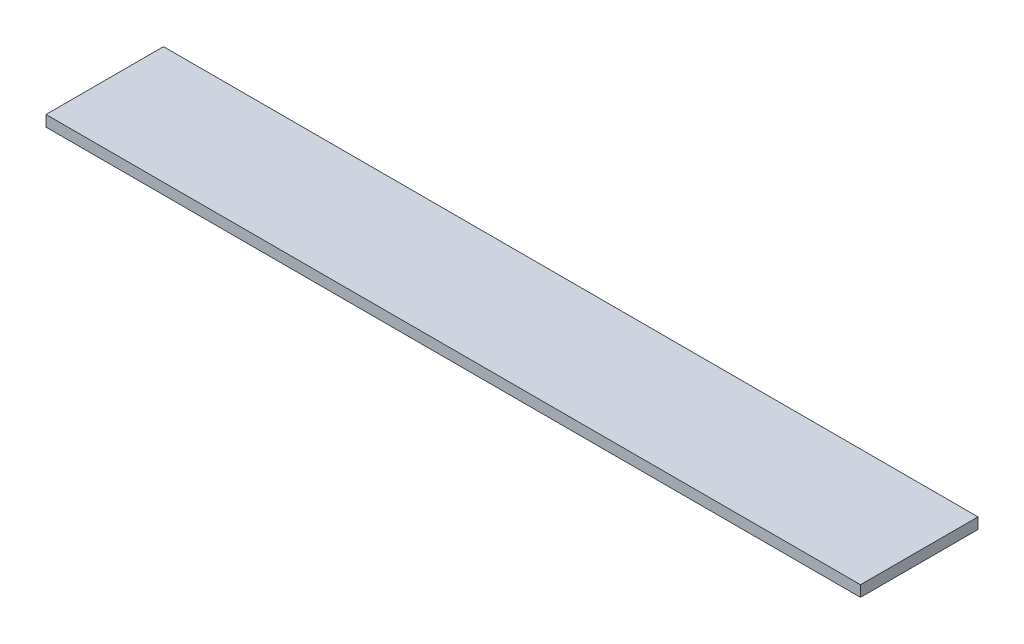
ISO-10303-21;
HEADER;
FILE_DESCRIPTION(('STEP AP214'),'2;1');
FILE_NAME('part.step','',(''),(''),'','','');
FILE_SCHEMA(('AUTOMOTIVE_DESIGN { 1 0 10303 214 1 1 1 1 }'));
ENDSEC;
DATA;
#1=APPLICATION_CONTEXT('core data for automotive mechanical design processes');
#2=APPLICATION_PROTOCOL_DEFINITION('international standard','automotive_design',2000,#1);
#3=PRODUCT_CONTEXT('',#1,'mechanical');
#4=PRODUCT('Part','Part','',(#3));
#5=PRODUCT_RELATED_PRODUCT_CATEGORY('part','',(#4));
#6=PRODUCT_DEFINITION_FORMATION('','',#4);
#7=PRODUCT_DEFINITION_CONTEXT('part definition',#1,'design');
#8=PRODUCT_DEFINITION('design','',#6,#7);
#9=PRODUCT_DEFINITION_SHAPE('','',#8);
#10=(LENGTH_UNIT() NAMED_UNIT(*) SI_UNIT(.MILLI.,.METRE.));
#11=(NAMED_UNIT(*) PLANE_ANGLE_UNIT() SI_UNIT($,.RADIAN.));
#12=(NAMED_UNIT(*) SI_UNIT($,.STERADIAN.) SOLID_ANGLE_UNIT());
#13=UNCERTAINTY_MEASURE_WITH_UNIT(LENGTH_MEASURE(1.E-05),#10,'distance_accuracy_value','');
#14=(GEOMETRIC_REPRESENTATION_CONTEXT(3) GLOBAL_UNCERTAINTY_ASSIGNED_CONTEXT((#13)) GLOBAL_UNIT_ASSIGNED_CONTEXT((#10,
#11,#12)) REPRESENTATION_CONTEXT('',''));
#15=CARTESIAN_POINT('',(0.,0.,0.));
#16=DIRECTION('',(0.,0.,1.));
#17=DIRECTION('',(1.,0.,0.));
#18=AXIS2_PLACEMENT_3D('',#15,#16,#17);
#19=CARTESIAN_POINT('',(0.,3.,0.));
#20=DIRECTION('',(-1.,0.,0.));
#21=DIRECTION('',(0.,0.,1.));
#22=AXIS2_PLACEMENT_3D('',#19,#20,#21);
#23=PLANE('',#22);
#24=DIRECTION('',(0.,0.,-1.));
#25=VECTOR('',#24,1.);
#26=CARTESIAN_POINT('',(0.,0.,0.));
#27=LINE('',#26,#25);
#28=CARTESIAN_POINT('',(0.,0.,0.));
#29=VERTEX_POINT('',#28);
#30=CARTESIAN_POINT('',(0.,0.,-32.1));
#31=VERTEX_POINT('',#30);
#32=EDGE_CURVE('E96',#29,#31,#27,.T.);
#33=ORIENTED_EDGE('',*,*,#32,.T.);
#34=DIRECTION('',(0.,-1.,0.));
#35=VECTOR('',#34,1.);
#36=CARTESIAN_POINT('',(0.,3.,-32.1));
#37=LINE('',#36,#35);
#38=CARTESIAN_POINT('',(0.,3.,-32.1));
#39=VERTEX_POINT('',#38);
#40=EDGE_CURVE('E11',#39,#31,#37,.T.);
#41=ORIENTED_EDGE('',*,*,#40,.F.);
#42=DIRECTION('',(0.,0.,-1.));
#43=VECTOR('',#42,1.);
#44=CARTESIAN_POINT('',(0.,3.,0.));
#45=LINE('',#44,#43);
#46=CARTESIAN_POINT('',(0.,3.,0.));
#47=VERTEX_POINT('',#46);
#48=EDGE_CURVE('E84',#47,#39,#45,.T.);
#49=ORIENTED_EDGE('',*,*,#48,.F.);
#50=DIRECTION('',(0.,-1.,0.));
#51=VECTOR('',#50,1.);
#52=CARTESIAN_POINT('',(0.,3.,0.));
#53=LINE('',#52,#51);
#54=EDGE_CURVE('E92',#47,#29,#53,.T.);
#55=ORIENTED_EDGE('',*,*,#54,.T.);
#56=EDGE_LOOP('',(#33,#41,#49,#55));
#57=FACE_BOUND('',#56,.T.);
#58=ADVANCED_FACE('F33',(#57),#23,.F.);
#59=CARTESIAN_POINT('',(0.,3.,-32.1));
#60=DIRECTION('',(0.,0.,1.));
#61=DIRECTION('',(1.,0.,0.));
#62=AXIS2_PLACEMENT_3D('',#59,#60,#61);
#63=PLANE('',#62);
#64=DIRECTION('',(-1.,0.,0.));
#65=VECTOR('',#64,1.);
#66=CARTESIAN_POINT('',(0.,0.,-32.1));
#67=LINE('',#66,#65);
#68=CARTESIAN_POINT('',(-222.5,0.,-32.1));
#69=VERTEX_POINT('',#68);
#70=EDGE_CURVE('E88',#31,#69,#67,.T.);
#71=ORIENTED_EDGE('',*,*,#70,.T.);
#72=DIRECTION('',(0.,-1.,0.));
#73=VECTOR('',#72,1.);
#74=CARTESIAN_POINT('',(-222.5,3.,-32.1));
#75=LINE('',#74,#73);
#76=CARTESIAN_POINT('',(-222.5,3.,-32.1));
#77=VERTEX_POINT('',#76);
#78=EDGE_CURVE('E41',#77,#69,#75,.T.);
#79=ORIENTED_EDGE('',*,*,#78,.F.);
#80=DIRECTION('',(-1.,0.,0.));
#81=VECTOR('',#80,1.);
#82=CARTESIAN_POINT('',(0.,3.,-32.1));
#83=LINE('',#82,#81);
#84=EDGE_CURVE('E79',#39,#77,#83,.T.);
#85=ORIENTED_EDGE('',*,*,#84,.F.);
#86=ORIENTED_EDGE('',*,*,#40,.T.);
#87=EDGE_LOOP('',(#71,#79,#85,#86));
#88=FACE_BOUND('',#87,.T.);
#89=ADVANCED_FACE('F87',(#88),#63,.F.);
#90=CARTESIAN_POINT('',(-222.5,3.,0.));
#91=DIRECTION('',(1.,0.,0.));
#92=DIRECTION('',(0.,0.,-1.));
#93=AXIS2_PLACEMENT_3D('',#90,#91,#92);
#94=PLANE('',#93);
#95=DIRECTION('',(0.,0.,1.));
#96=VECTOR('',#95,1.);
#97=CARTESIAN_POINT('',(-222.5,0.,0.));
#98=LINE('',#97,#96);
#99=CARTESIAN_POINT('',(-222.5,0.,0.));
#100=VERTEX_POINT('',#99);
#101=EDGE_CURVE('E66',#69,#100,#98,.T.);
#102=ORIENTED_EDGE('',*,*,#101,.T.);
#103=DIRECTION('',(0.,-1.,0.));
#104=VECTOR('',#103,1.);
#105=CARTESIAN_POINT('',(-222.5,3.,0.));
#106=LINE('',#105,#104);
#107=CARTESIAN_POINT('',(-222.5,3.,0.));
#108=VERTEX_POINT('',#107);
#109=EDGE_CURVE('E89',#108,#100,#106,.T.);
#110=ORIENTED_EDGE('',*,*,#109,.F.);
#111=DIRECTION('',(0.,0.,1.));
#112=VECTOR('',#111,1.);
#113=CARTESIAN_POINT('',(-222.5,3.,0.));
#114=LINE('',#113,#112);
#115=EDGE_CURVE('E82',#77,#108,#114,.T.);
#116=ORIENTED_EDGE('',*,*,#115,.F.);
#117=ORIENTED_EDGE('',*,*,#78,.T.);
#118=EDGE_LOOP('',(#102,#110,#116,#117));
#119=FACE_BOUND('',#118,.T.);
#120=ADVANCED_FACE('F90',(#119),#94,.F.);
#121=CARTESIAN_POINT('',(0.,3.,0.));
#122=DIRECTION('',(0.,0.,-1.));
#123=DIRECTION('',(-1.,0.,0.));
#124=AXIS2_PLACEMENT_3D('',#121,#122,#123);
#125=PLANE('',#124);
#126=DIRECTION('',(1.,0.,0.));
#127=VECTOR('',#126,1.);
#128=CARTESIAN_POINT('',(0.,0.,0.));
#129=LINE('',#128,#127);
#130=EDGE_CURVE('E72',#100,#29,#129,.T.);
#131=ORIENTED_EDGE('',*,*,#130,.T.);
#132=ORIENTED_EDGE('',*,*,#54,.F.);
#133=DIRECTION('',(1.,0.,0.));
#134=VECTOR('',#133,1.);
#135=CARTESIAN_POINT('',(0.,3.,0.));
#136=LINE('',#135,#134);
#137=EDGE_CURVE('E49',#108,#47,#136,.T.);
#138=ORIENTED_EDGE('',*,*,#137,.F.);
#139=ORIENTED_EDGE('',*,*,#109,.T.);
#140=EDGE_LOOP('',(#131,#132,#138,#139));
#141=FACE_BOUND('',#140,.T.);
#142=ADVANCED_FACE('F103',(#141),#125,.F.);
#143=CARTESIAN_POINT('',(0.,3.,0.));
#144=DIRECTION('',(0.,1.,0.));
#145=DIRECTION('',(0.,0.,1.));
#146=AXIS2_PLACEMENT_3D('',#143,#144,#145);
#147=PLANE('',#146);
#148=ORIENTED_EDGE('',*,*,#48,.T.);
#149=ORIENTED_EDGE('',*,*,#84,.T.);
#150=ORIENTED_EDGE('',*,*,#115,.T.);
#151=ORIENTED_EDGE('',*,*,#137,.T.);
#152=EDGE_LOOP('',(#148,#149,#150,#151));
#153=FACE_BOUND('',#152,.T.);
#154=ADVANCED_FACE('F80',(#153),#147,.T.);
#155=CARTESIAN_POINT('',(0.,0.,0.));
#156=DIRECTION('',(0.,1.,0.));
#157=DIRECTION('',(0.,0.,1.));
#158=AXIS2_PLACEMENT_3D('',#155,#156,#157);
#159=PLANE('',#158);
#160=ORIENTED_EDGE('',*,*,#32,.F.);
#161=ORIENTED_EDGE('',*,*,#130,.F.);
#162=ORIENTED_EDGE('',*,*,#101,.F.);
#163=ORIENTED_EDGE('',*,*,#70,.F.);
#164=EDGE_LOOP('',(#160,#161,#162,#163));
#165=FACE_BOUND('',#164,.T.);
#166=ADVANCED_FACE('F106',(#165),#159,.F.);
#167=CLOSED_SHELL('',(#58,#89,#120,#142,#154,#166));
#168=MANIFOLD_SOLID_BREP('B2',#167);
#169=ADVANCED_BREP_SHAPE_REPRESENTATION('',(#18,#168),#14);
#170=SHAPE_DEFINITION_REPRESENTATION(#9,#169);
ENDSEC;
END-ISO-10303-21;
